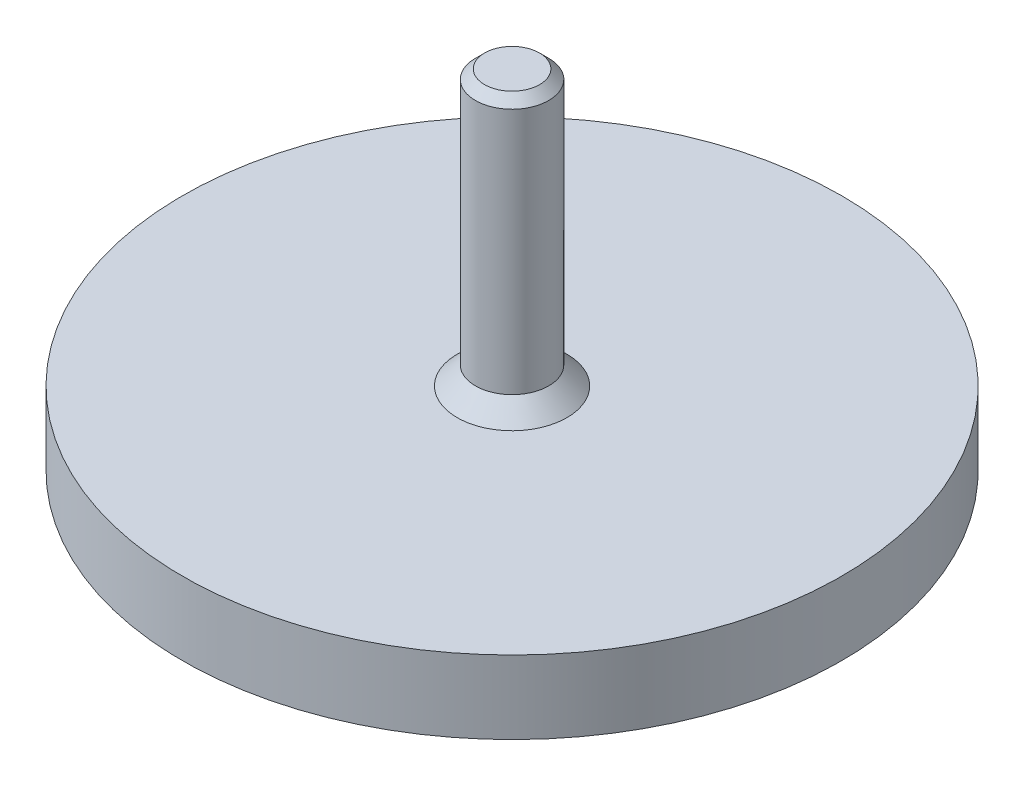
ISO-10303-21;
HEADER;
FILE_DESCRIPTION(('STEP AP214'),'2;1');
FILE_NAME('part.step','',(''),(''),'','','');
FILE_SCHEMA(('AUTOMOTIVE_DESIGN { 1 0 10303 214 1 1 1 1 }'));
ENDSEC;
DATA;
#1=APPLICATION_CONTEXT('core data for automotive mechanical design processes');
#2=APPLICATION_PROTOCOL_DEFINITION('international standard','automotive_design',2000,#1);
#3=PRODUCT_CONTEXT('',#1,'mechanical');
#4=PRODUCT('Part','Part','',(#3));
#5=PRODUCT_RELATED_PRODUCT_CATEGORY('part','',(#4));
#6=PRODUCT_DEFINITION_FORMATION('','',#4);
#7=PRODUCT_DEFINITION_CONTEXT('part definition',#1,'design');
#8=PRODUCT_DEFINITION('design','',#6,#7);
#9=PRODUCT_DEFINITION_SHAPE('','',#8);
#10=(LENGTH_UNIT() NAMED_UNIT(*) SI_UNIT(.MILLI.,.METRE.));
#11=(NAMED_UNIT(*) PLANE_ANGLE_UNIT() SI_UNIT($,.RADIAN.));
#12=(NAMED_UNIT(*) SI_UNIT($,.STERADIAN.) SOLID_ANGLE_UNIT());
#13=UNCERTAINTY_MEASURE_WITH_UNIT(LENGTH_MEASURE(1.E-05),#10,'distance_accuracy_value','');
#14=(GEOMETRIC_REPRESENTATION_CONTEXT(3) GLOBAL_UNCERTAINTY_ASSIGNED_CONTEXT((#13)) GLOBAL_UNIT_ASSIGNED_CONTEXT((#10,
#11,#12)) REPRESENTATION_CONTEXT('',''));
#15=CARTESIAN_POINT('',(0.,0.,0.));
#16=DIRECTION('',(0.,0.,1.));
#17=DIRECTION('',(1.,0.,0.));
#18=AXIS2_PLACEMENT_3D('',#15,#16,#17);
#19=CARTESIAN_POINT('',(0.,0.,0.));
#20=DIRECTION('',(0.,1.,0.));
#21=DIRECTION('',(0.,0.,1.));
#22=AXIS2_PLACEMENT_3D('',#19,#20,#21);
#23=PLANE('',#22);
#24=CARTESIAN_POINT('',(0.,0.,0.));
#25=DIRECTION('',(0.,-1.,0.));
#26=DIRECTION('',(0.,0.,-1.));
#27=AXIS2_PLACEMENT_3D('',#24,#25,#26);
#28=CIRCLE('',#27,18.);
#29=CARTESIAN_POINT('',(0.,0.,-18.));
#30=VERTEX_POINT('',#29);
#31=EDGE_CURVE('E48',#30,#30,#28,.T.);
#32=ORIENTED_EDGE('',*,*,#31,.T.);
#33=EDGE_LOOP('',(#32));
#34=FACE_BOUND('',#33,.T.);
#35=ADVANCED_FACE('F28',(#34),#23,.F.);
#36=CARTESIAN_POINT('',(0.,0.,0.));
#37=DIRECTION('',(0.,-1.,0.));
#38=DIRECTION('',(0.,0.,-1.));
#39=AXIS2_PLACEMENT_3D('',#36,#37,#38);
#40=CYLINDRICAL_SURFACE('',#39,18.);
#41=ORIENTED_EDGE('',*,*,#31,.F.);
#42=EDGE_LOOP('',(#41));
#43=FACE_BOUND('',#42,.T.);
#44=CARTESIAN_POINT('',(0.,4.,0.));
#45=DIRECTION('',(0.,-1.,0.));
#46=DIRECTION('',(0.,0.,-1.));
#47=AXIS2_PLACEMENT_3D('',#44,#45,#46);
#48=CIRCLE('',#47,18.);
#49=CARTESIAN_POINT('',(0.,4.,-18.));
#50=VERTEX_POINT('',#49);
#51=EDGE_CURVE('E51',#50,#50,#48,.T.);
#52=ORIENTED_EDGE('',*,*,#51,.T.);
#53=EDGE_LOOP('',(#52));
#54=FACE_BOUND('',#53,.T.);
#55=ADVANCED_FACE('F55',(#43,#54),#40,.T.);
#56=CARTESIAN_POINT('',(-18.,4.,0.));
#57=DIRECTION('',(0.,-1.,0.));
#58=DIRECTION('',(0.,0.,-1.));
#59=AXIS2_PLACEMENT_3D('',#56,#57,#58);
#60=PLANE('',#59);
#61=CARTESIAN_POINT('',(0.,4.,0.));
#62=DIRECTION('',(0.,-1.,0.));
#63=DIRECTION('',(0.,0.,-1.));
#64=AXIS2_PLACEMENT_3D('',#61,#62,#63);
#65=CIRCLE('',#64,3.);
#66=CARTESIAN_POINT('',(0.,4.,-3.));
#67=VERTEX_POINT('',#66);
#68=EDGE_CURVE('E43',#67,#67,#65,.T.);
#69=ORIENTED_EDGE('',*,*,#68,.T.);
#70=EDGE_LOOP('',(#69));
#71=FACE_BOUND('',#70,.T.);
#72=ORIENTED_EDGE('',*,*,#51,.F.);
#73=EDGE_LOOP('',(#72));
#74=FACE_BOUND('',#73,.T.);
#75=ADVANCED_FACE('F57',(#71,#74),#60,.F.);
#76=CARTESIAN_POINT('',(0.,0.,0.));
#77=DIRECTION('',(0.,-1.,0.));
#78=DIRECTION('',(0.,0.,-1.));
#79=AXIS2_PLACEMENT_3D('',#76,#77,#78);
#80=CYLINDRICAL_SURFACE('',#79,2.);
#81=CARTESIAN_POINT('',(0.,18.5,0.));
#82=DIRECTION('',(0.,-1.,0.));
#83=DIRECTION('',(0.,0.,-1.));
#84=AXIS2_PLACEMENT_3D('',#81,#82,#83);
#85=CIRCLE('',#84,2.);
#86=CARTESIAN_POINT('',(0.,18.5,-2.));
#87=VERTEX_POINT('',#86);
#88=EDGE_CURVE('E35',#87,#87,#85,.T.);
#89=ORIENTED_EDGE('',*,*,#88,.T.);
#90=EDGE_LOOP('',(#89));
#91=FACE_BOUND('',#90,.T.);
#92=CARTESIAN_POINT('',(0.,4.99999999999999,0.));
#93=DIRECTION('',(0.,-1.,0.));
#94=DIRECTION('',(0.,0.,-1.));
#95=AXIS2_PLACEMENT_3D('',#92,#93,#94);
#96=CIRCLE('',#95,2.);
#97=CARTESIAN_POINT('',(0.,4.99999999999999,-2.));
#98=VERTEX_POINT('',#97);
#99=EDGE_CURVE('E39',#98,#98,#96,.F.);
#100=ORIENTED_EDGE('',*,*,#99,.T.);
#101=EDGE_LOOP('',(#100));
#102=FACE_BOUND('',#101,.T.);
#103=ADVANCED_FACE('F59',(#91,#102),#80,.T.);
#104=CARTESIAN_POINT('',(-2.,19.,0.));
#105=DIRECTION('',(0.,-1.,0.));
#106=DIRECTION('',(0.,0.,-1.));
#107=AXIS2_PLACEMENT_3D('',#104,#105,#106);
#108=PLANE('',#107);
#109=CARTESIAN_POINT('',(0.,19.,0.));
#110=DIRECTION('',(0.,-1.,0.));
#111=DIRECTION('',(0.,0.,-1.));
#112=AXIS2_PLACEMENT_3D('',#109,#110,#111);
#113=CIRCLE('',#112,1.5);
#114=CARTESIAN_POINT('',(0.,19.,-1.5));
#115=VERTEX_POINT('',#114);
#116=EDGE_CURVE('E10',#115,#115,#113,.F.);
#117=ORIENTED_EDGE('',*,*,#116,.T.);
#118=EDGE_LOOP('',(#117));
#119=FACE_BOUND('',#118,.T.);
#120=ADVANCED_FACE('F66',(#119),#108,.F.);
#121=CARTESIAN_POINT('',(0.,4.,0.));
#122=DIRECTION('',(0.,-1.,0.));
#123=DIRECTION('',(0.,0.,-1.));
#124=AXIS2_PLACEMENT_3D('',#121,#122,#123);
#125=CONICAL_SURFACE('',#124,3.,0.785398163397455);
#126=ORIENTED_EDGE('',*,*,#99,.F.);
#127=EDGE_LOOP('',(#126));
#128=FACE_BOUND('',#127,.T.);
#129=ORIENTED_EDGE('',*,*,#68,.F.);
#130=EDGE_LOOP('',(#129));
#131=FACE_BOUND('',#130,.T.);
#132=ADVANCED_FACE('F75',(#128,#131),#125,.T.);
#133=CARTESIAN_POINT('',(0.,18.5,0.));
#134=DIRECTION('',(0.,-1.,0.));
#135=DIRECTION('',(0.,0.,-1.));
#136=AXIS2_PLACEMENT_3D('',#133,#134,#135);
#137=CONICAL_SURFACE('',#136,2.,0.785398163397454);
#138=ORIENTED_EDGE('',*,*,#116,.F.);
#139=EDGE_LOOP('',(#138));
#140=FACE_BOUND('',#139,.T.);
#141=ORIENTED_EDGE('',*,*,#88,.F.);
#142=EDGE_LOOP('',(#141));
#143=FACE_BOUND('',#142,.T.);
#144=ADVANCED_FACE('F30',(#140,#143),#137,.T.);
#145=CLOSED_SHELL('',(#35,#55,#75,#103,#120,#132,#144));
#146=MANIFOLD_SOLID_BREP('B2',#145);
#147=ADVANCED_BREP_SHAPE_REPRESENTATION('',(#18,#146),#14);
#148=SHAPE_DEFINITION_REPRESENTATION(#9,#147);
ENDSEC;
END-ISO-10303-21;
